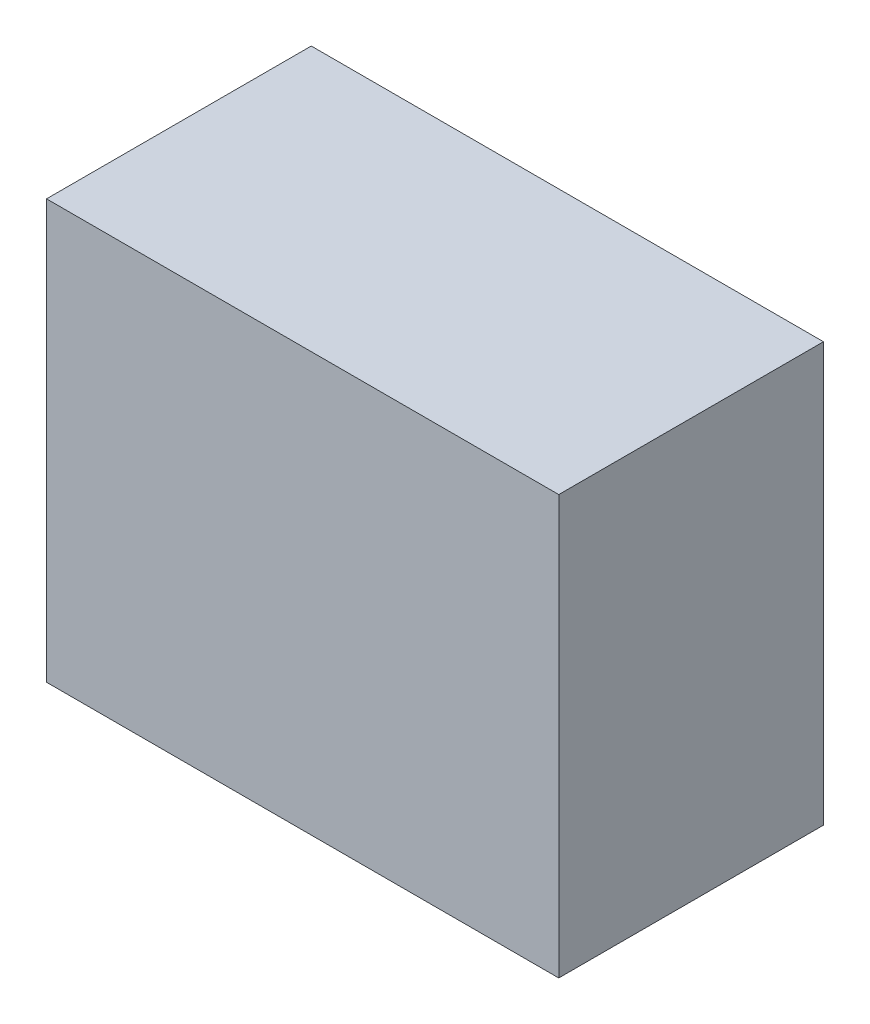
ISO-10303-21;
HEADER;
FILE_DESCRIPTION(('STEP AP214'),'2;1');
FILE_NAME('part.step','',(''),(''),'','','');
FILE_SCHEMA(('AUTOMOTIVE_DESIGN { 1 0 10303 214 1 1 1 1 }'));
ENDSEC;
DATA;
#1=APPLICATION_CONTEXT('core data for automotive mechanical design processes');
#2=APPLICATION_PROTOCOL_DEFINITION('international standard','automotive_design',2000,#1);
#3=PRODUCT_CONTEXT('',#1,'mechanical');
#4=PRODUCT('Part','Part','',(#3));
#5=PRODUCT_RELATED_PRODUCT_CATEGORY('part','',(#4));
#6=PRODUCT_DEFINITION_FORMATION('','',#4);
#7=PRODUCT_DEFINITION_CONTEXT('part definition',#1,'design');
#8=PRODUCT_DEFINITION('design','',#6,#7);
#9=PRODUCT_DEFINITION_SHAPE('','',#8);
#10=(LENGTH_UNIT() NAMED_UNIT(*) SI_UNIT(.MILLI.,.METRE.));
#11=(NAMED_UNIT(*) PLANE_ANGLE_UNIT() SI_UNIT($,.RADIAN.));
#12=(NAMED_UNIT(*) SI_UNIT($,.STERADIAN.) SOLID_ANGLE_UNIT());
#13=UNCERTAINTY_MEASURE_WITH_UNIT(LENGTH_MEASURE(1.E-05),#10,'distance_accuracy_value','');
#14=(GEOMETRIC_REPRESENTATION_CONTEXT(3) GLOBAL_UNCERTAINTY_ASSIGNED_CONTEXT((#13)) GLOBAL_UNIT_ASSIGNED_CONTEXT((#10,
#11,#12)) REPRESENTATION_CONTEXT('',''));
#15=CARTESIAN_POINT('',(0.,0.,0.));
#16=DIRECTION('',(0.,0.,1.));
#17=DIRECTION('',(1.,0.,0.));
#18=AXIS2_PLACEMENT_3D('',#15,#16,#17);
#19=CARTESIAN_POINT('',(-0.58050684,-0.47448978,0.));
#20=DIRECTION('',(-1.,0.,0.));
#21=DIRECTION('',(0.,1.,0.));
#22=AXIS2_PLACEMENT_3D('',#19,#20,#21);
#23=PLANE('',#22);
#24=DIRECTION('',(0.,0.,1.));
#25=VECTOR('',#24,1.);
#26=CARTESIAN_POINT('',(-0.58050684,-0.47448978,0.));
#27=LINE('',#26,#25);
#28=CARTESIAN_POINT('',(-0.58050684,-0.47448978,0.));
#29=VERTEX_POINT('',#28);
#30=CARTESIAN_POINT('',(-0.58050684,-0.47448978,0.5999988));
#31=VERTEX_POINT('',#30);
#32=EDGE_CURVE('E11',#29,#31,#27,.T.);
#33=ORIENTED_EDGE('',*,*,#32,.T.);
#34=DIRECTION('',(0.,1.,0.));
#35=VECTOR('',#34,1.);
#36=CARTESIAN_POINT('',(-0.58050684,-0.47448978,0.5999988));
#37=LINE('',#36,#35);
#38=CARTESIAN_POINT('',(-0.58050684,0.47449232,0.5999988));
#39=VERTEX_POINT('',#38);
#40=EDGE_CURVE('E24',#31,#39,#37,.T.);
#41=ORIENTED_EDGE('',*,*,#40,.T.);
#42=DIRECTION('',(0.,0.,1.));
#43=VECTOR('',#42,1.);
#44=CARTESIAN_POINT('',(-0.58050684,0.47449232,0.));
#45=LINE('',#44,#43);
#46=CARTESIAN_POINT('',(-0.58050684,0.47449232,0.));
#47=VERTEX_POINT('',#46);
#48=EDGE_CURVE('E85',#47,#39,#45,.T.);
#49=ORIENTED_EDGE('',*,*,#48,.F.);
#50=DIRECTION('',(0.,1.,0.));
#51=VECTOR('',#50,1.);
#52=CARTESIAN_POINT('',(-0.58050684,-0.47448978,0.));
#53=LINE('',#52,#51);
#54=EDGE_CURVE('E83',#29,#47,#53,.T.);
#55=ORIENTED_EDGE('',*,*,#54,.F.);
#56=EDGE_LOOP('',(#33,#41,#49,#55));
#57=FACE_BOUND('',#56,.T.);
#58=ADVANCED_FACE('F17',(#57),#23,.T.);
#59=CARTESIAN_POINT('',(-0.58050684,0.47449232,0.));
#60=DIRECTION('',(0.,1.,0.));
#61=DIRECTION('',(1.,0.,0.));
#62=AXIS2_PLACEMENT_3D('',#59,#60,#61);
#63=PLANE('',#62);
#64=ORIENTED_EDGE('',*,*,#48,.T.);
#65=DIRECTION('',(1.,0.,0.));
#66=VECTOR('',#65,1.);
#67=CARTESIAN_POINT('',(-0.58050684,0.47449232,0.5999988));
#68=LINE('',#67,#66);
#69=CARTESIAN_POINT('',(0.58050684,0.47449232,0.5999988));
#70=VERTEX_POINT('',#69);
#71=EDGE_CURVE('E81',#39,#70,#68,.T.);
#72=ORIENTED_EDGE('',*,*,#71,.T.);
#73=DIRECTION('',(0.,0.,1.));
#74=VECTOR('',#73,1.);
#75=CARTESIAN_POINT('',(0.58050684,0.47449232,0.));
#76=LINE('',#75,#74);
#77=CARTESIAN_POINT('',(0.58050684,0.47449232,0.));
#78=VERTEX_POINT('',#77);
#79=EDGE_CURVE('E79',#78,#70,#76,.T.);
#80=ORIENTED_EDGE('',*,*,#79,.F.);
#81=DIRECTION('',(1.,0.,0.));
#82=VECTOR('',#81,1.);
#83=CARTESIAN_POINT('',(-0.58050684,0.47449232,0.));
#84=LINE('',#83,#82);
#85=EDGE_CURVE('E70',#47,#78,#84,.T.);
#86=ORIENTED_EDGE('',*,*,#85,.F.);
#87=EDGE_LOOP('',(#64,#72,#80,#86));
#88=FACE_BOUND('',#87,.T.);
#89=ADVANCED_FACE('F90',(#88),#63,.T.);
#90=CARTESIAN_POINT('',(0.58050684,0.47449232,0.));
#91=DIRECTION('',(1.,0.,0.));
#92=DIRECTION('',(0.,-1.,0.));
#93=AXIS2_PLACEMENT_3D('',#90,#91,#92);
#94=PLANE('',#93);
#95=ORIENTED_EDGE('',*,*,#79,.T.);
#96=DIRECTION('',(0.,-1.,0.));
#97=VECTOR('',#96,1.);
#98=CARTESIAN_POINT('',(0.58050684,0.47449232,0.5999988));
#99=LINE('',#98,#97);
#100=CARTESIAN_POINT('',(0.58050684,-0.47448978,0.5999988));
#101=VERTEX_POINT('',#100);
#102=EDGE_CURVE('E60',#70,#101,#99,.T.);
#103=ORIENTED_EDGE('',*,*,#102,.T.);
#104=DIRECTION('',(0.,0.,1.));
#105=VECTOR('',#104,1.);
#106=CARTESIAN_POINT('',(0.58050684,-0.47448978,0.));
#107=LINE('',#106,#105);
#108=CARTESIAN_POINT('',(0.58050684,-0.47448978,0.));
#109=VERTEX_POINT('',#108);
#110=EDGE_CURVE('E54',#109,#101,#107,.T.);
#111=ORIENTED_EDGE('',*,*,#110,.F.);
#112=DIRECTION('',(0.,-1.,0.));
#113=VECTOR('',#112,1.);
#114=CARTESIAN_POINT('',(0.58050684,0.47449232,0.));
#115=LINE('',#114,#113);
#116=EDGE_CURVE('E58',#78,#109,#115,.T.);
#117=ORIENTED_EDGE('',*,*,#116,.F.);
#118=EDGE_LOOP('',(#95,#103,#111,#117));
#119=FACE_BOUND('',#118,.T.);
#120=ADVANCED_FACE('F57',(#119),#94,.T.);
#121=CARTESIAN_POINT('',(0.58050684,-0.47448978,0.));
#122=DIRECTION('',(0.,-1.,0.));
#123=DIRECTION('',(-1.,0.,0.));
#124=AXIS2_PLACEMENT_3D('',#121,#122,#123);
#125=PLANE('',#124);
#126=ORIENTED_EDGE('',*,*,#110,.T.);
#127=DIRECTION('',(-1.,0.,0.));
#128=VECTOR('',#127,1.);
#129=CARTESIAN_POINT('',(0.58050684,-0.47448978,0.5999988));
#130=LINE('',#129,#128);
#131=EDGE_CURVE('E71',#101,#31,#130,.T.);
#132=ORIENTED_EDGE('',*,*,#131,.T.);
#133=ORIENTED_EDGE('',*,*,#32,.F.);
#134=DIRECTION('',(-1.,0.,0.));
#135=VECTOR('',#134,1.);
#136=CARTESIAN_POINT('',(0.58050684,-0.47448978,0.));
#137=LINE('',#136,#135);
#138=EDGE_CURVE('E68',#109,#29,#137,.T.);
#139=ORIENTED_EDGE('',*,*,#138,.F.);
#140=EDGE_LOOP('',(#126,#132,#133,#139));
#141=FACE_BOUND('',#140,.T.);
#142=ADVANCED_FACE('F73',(#141),#125,.T.);
#143=CARTESIAN_POINT('',(-0.58050684,-0.47448978,0.));
#144=DIRECTION('',(0.,0.,1.));
#145=DIRECTION('',(1.,0.,0.));
#146=AXIS2_PLACEMENT_3D('',#143,#144,#145);
#147=PLANE('',#146);
#148=ORIENTED_EDGE('',*,*,#54,.T.);
#149=ORIENTED_EDGE('',*,*,#85,.T.);
#150=ORIENTED_EDGE('',*,*,#116,.T.);
#151=ORIENTED_EDGE('',*,*,#138,.T.);
#152=EDGE_LOOP('',(#148,#149,#150,#151));
#153=FACE_BOUND('',#152,.T.);
#154=ADVANCED_FACE('F67',(#153),#147,.F.);
#155=CARTESIAN_POINT('',(-0.58050684,-0.47448978,0.5999988));
#156=DIRECTION('',(0.,0.,1.));
#157=DIRECTION('',(1.,0.,0.));
#158=AXIS2_PLACEMENT_3D('',#155,#156,#157);
#159=PLANE('',#158);
#160=ORIENTED_EDGE('',*,*,#131,.F.);
#161=ORIENTED_EDGE('',*,*,#102,.F.);
#162=ORIENTED_EDGE('',*,*,#71,.F.);
#163=ORIENTED_EDGE('',*,*,#40,.F.);
#164=EDGE_LOOP('',(#160,#161,#162,#163));
#165=FACE_BOUND('',#164,.T.);
#166=ADVANCED_FACE('F91',(#165),#159,.T.);
#167=CLOSED_SHELL('',(#58,#89,#120,#142,#154,#166));
#168=MANIFOLD_SOLID_BREP('B1',#167);
#169=ADVANCED_BREP_SHAPE_REPRESENTATION('',(#18,#168),#14);
#170=SHAPE_DEFINITION_REPRESENTATION(#9,#169);
ENDSEC;
END-ISO-10303-21;
